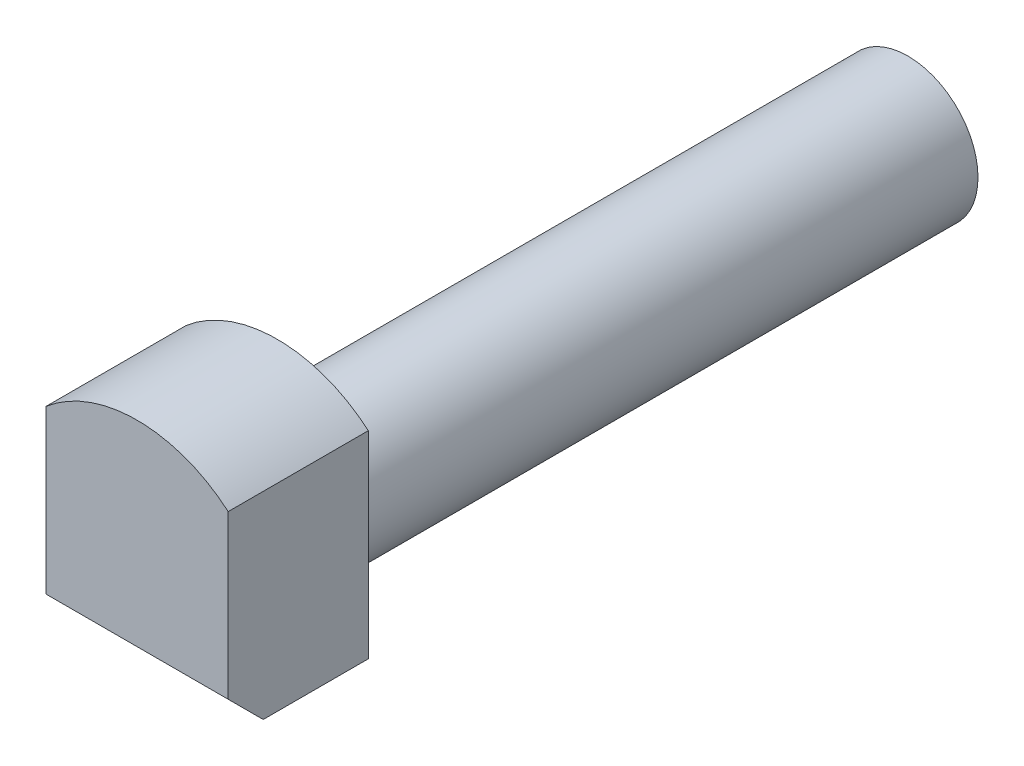
ISO-10303-21;
HEADER;
FILE_DESCRIPTION(('STEP AP214'),'2;1');
FILE_NAME('part.step','',(''),(''),'','','');
FILE_SCHEMA(('AUTOMOTIVE_DESIGN { 1 0 10303 214 1 1 1 1 }'));
ENDSEC;
DATA;
#1=APPLICATION_CONTEXT('core data for automotive mechanical design processes');
#2=APPLICATION_PROTOCOL_DEFINITION('international standard','automotive_design',2000,#1);
#3=PRODUCT_CONTEXT('',#1,'mechanical');
#4=PRODUCT('Part','Part','',(#3));
#5=PRODUCT_RELATED_PRODUCT_CATEGORY('part','',(#4));
#6=PRODUCT_DEFINITION_FORMATION('','',#4);
#7=PRODUCT_DEFINITION_CONTEXT('part definition',#1,'design');
#8=PRODUCT_DEFINITION('design','',#6,#7);
#9=PRODUCT_DEFINITION_SHAPE('','',#8);
#10=(LENGTH_UNIT() NAMED_UNIT(*) SI_UNIT(.MILLI.,.METRE.));
#11=(NAMED_UNIT(*) PLANE_ANGLE_UNIT() SI_UNIT($,.RADIAN.));
#12=(NAMED_UNIT(*) SI_UNIT($,.STERADIAN.) SOLID_ANGLE_UNIT());
#13=UNCERTAINTY_MEASURE_WITH_UNIT(LENGTH_MEASURE(1.E-05),#10,'distance_accuracy_value','');
#14=(GEOMETRIC_REPRESENTATION_CONTEXT(3) GLOBAL_UNCERTAINTY_ASSIGNED_CONTEXT((#13)) GLOBAL_UNIT_ASSIGNED_CONTEXT((#10,
#11,#12)) REPRESENTATION_CONTEXT('',''));
#15=CARTESIAN_POINT('',(0.,0.,0.));
#16=DIRECTION('',(0.,0.,1.));
#17=DIRECTION('',(1.,0.,0.));
#18=AXIS2_PLACEMENT_3D('',#15,#16,#17);
#19=CARTESIAN_POINT('',(2.7,1.35,-14.8284271247462));
#20=DIRECTION('',(0.,0.,1.));
#21=DIRECTION('',(1.,0.,0.));
#22=AXIS2_PLACEMENT_3D('',#19,#20,#21);
#23=CYLINDRICAL_SURFACE('',#22,1.);
#24=CARTESIAN_POINT('',(2.7,1.35,3.5));
#25=DIRECTION('',(0.,0.,1.));
#26=DIRECTION('',(1.,0.,0.));
#27=AXIS2_PLACEMENT_3D('',#24,#25,#26);
#28=CIRCLE('',#27,1.);
#29=CARTESIAN_POINT('',(3.7,1.35,3.5));
#30=VERTEX_POINT('',#29);
#31=EDGE_CURVE('E97',#30,#30,#28,.T.);
#32=ORIENTED_EDGE('',*,*,#31,.F.);
#33=EDGE_LOOP('',(#32));
#34=FACE_BOUND('',#33,.T.);
#35=CARTESIAN_POINT('',(2.7,1.35,-5.5));
#36=DIRECTION('',(0.,0.,-1.));
#37=DIRECTION('',(-1.,0.,0.));
#38=AXIS2_PLACEMENT_3D('',#35,#36,#37);
#39=CIRCLE('',#38,1.);
#40=CARTESIAN_POINT('',(1.7,1.35,-5.5));
#41=VERTEX_POINT('',#40);
#42=EDGE_CURVE('E141',#41,#41,#39,.T.);
#43=ORIENTED_EDGE('',*,*,#42,.F.);
#44=EDGE_LOOP('',(#43));
#45=FACE_BOUND('',#44,.T.);
#46=ADVANCED_FACE('F39',(#34,#45),#23,.T.);
#47=CARTESIAN_POINT('',(2.7,1.35,5.5));
#48=DIRECTION('',(0.,0.,-1.));
#49=DIRECTION('',(-1.,0.,0.));
#50=AXIS2_PLACEMENT_3D('',#47,#48,#49);
#51=CYLINDRICAL_SURFACE('',#50,2.);
#52=DIRECTION('',(0.,0.,1.));
#53=VECTOR('',#52,1.);
#54=CARTESIAN_POINT('',(4.,2.86986841535707,-11.));
#55=LINE('',#54,#53);
#56=CARTESIAN_POINT('',(4.,2.86986841535707,3.5));
#57=VERTEX_POINT('',#56);
#58=CARTESIAN_POINT('',(4.,2.86986841535707,5.5));
#59=VERTEX_POINT('',#58);
#60=EDGE_CURVE('E126',#57,#59,#55,.T.);
#61=ORIENTED_EDGE('',*,*,#60,.F.);
#62=CARTESIAN_POINT('',(2.7,1.35,3.5));
#63=DIRECTION('',(0.,0.,1.));
#64=DIRECTION('',(1.,0.,0.));
#65=AXIS2_PLACEMENT_3D('',#62,#63,#64);
#66=CIRCLE('',#65,2.);
#67=CARTESIAN_POINT('',(1.4,2.86986841535707,3.5));
#68=VERTEX_POINT('',#67);
#69=EDGE_CURVE('E113',#57,#68,#66,.T.);
#70=ORIENTED_EDGE('',*,*,#69,.T.);
#71=DIRECTION('',(0.,0.,1.));
#72=VECTOR('',#71,1.);
#73=CARTESIAN_POINT('',(1.4,2.86986841535707,-11.));
#74=LINE('',#73,#72);
#75=CARTESIAN_POINT('',(1.4,2.86986841535707,5.5));
#76=VERTEX_POINT('',#75);
#77=EDGE_CURVE('E91',#68,#76,#74,.T.);
#78=ORIENTED_EDGE('',*,*,#77,.T.);
#79=CARTESIAN_POINT('',(2.7,1.35,5.5));
#80=DIRECTION('',(0.,0.,-1.));
#81=DIRECTION('',(-1.,0.,0.));
#82=AXIS2_PLACEMENT_3D('',#79,#80,#81);
#83=CIRCLE('',#82,2.);
#84=EDGE_CURVE('E110',#59,#76,#83,.F.);
#85=ORIENTED_EDGE('',*,*,#84,.F.);
#86=EDGE_LOOP('',(#61,#70,#78,#85));
#87=FACE_BOUND('',#86,.T.);
#88=ADVANCED_FACE('F138',(#87),#51,.T.);
#89=CARTESIAN_POINT('',(2.7,1.35,5.5));
#90=DIRECTION('',(0.,0.,1.));
#91=DIRECTION('',(1.,0.,0.));
#92=AXIS2_PLACEMENT_3D('',#89,#90,#91);
#93=PLANE('',#92);
#94=DIRECTION('',(0.,-1.,0.));
#95=VECTOR('',#94,1.);
#96=CARTESIAN_POINT('',(1.4,1.35,5.5));
#97=LINE('',#96,#95);
#98=CARTESIAN_POINT('',(1.4,0.550000000000002,5.5));
#99=VERTEX_POINT('',#98);
#100=EDGE_CURVE('E122',#76,#99,#97,.T.);
#101=ORIENTED_EDGE('',*,*,#100,.T.);
#102=DIRECTION('',(1.,0.,0.));
#103=VECTOR('',#102,1.);
#104=CARTESIAN_POINT('',(2.7,0.550000000000002,5.5));
#105=LINE('',#104,#103);
#106=CARTESIAN_POINT('',(4.,0.550000000000002,5.5));
#107=VERTEX_POINT('',#106);
#108=EDGE_CURVE('E106',#99,#107,#105,.T.);
#109=ORIENTED_EDGE('',*,*,#108,.T.);
#110=DIRECTION('',(0.,1.,0.));
#111=VECTOR('',#110,1.);
#112=CARTESIAN_POINT('',(4.,1.35,5.5));
#113=LINE('',#112,#111);
#114=EDGE_CURVE('E120',#107,#59,#113,.T.);
#115=ORIENTED_EDGE('',*,*,#114,.T.);
#116=ORIENTED_EDGE('',*,*,#84,.T.);
#117=EDGE_LOOP('',(#101,#109,#115,#116));
#118=FACE_BOUND('',#117,.T.);
#119=ADVANCED_FACE('F119',(#118),#93,.T.);
#120=CARTESIAN_POINT('',(2.7,1.35,3.5));
#121=DIRECTION('',(0.,0.,1.));
#122=DIRECTION('',(1.,0.,0.));
#123=AXIS2_PLACEMENT_3D('',#120,#121,#122);
#124=PLANE('',#123);
#125=ORIENTED_EDGE('',*,*,#31,.T.);
#126=EDGE_LOOP('',(#125));
#127=FACE_BOUND('',#126,.T.);
#128=DIRECTION('',(0.,1.,0.));
#129=VECTOR('',#128,1.);
#130=CARTESIAN_POINT('',(4.,1.35,3.5));
#131=LINE('',#130,#129);
#132=CARTESIAN_POINT('',(4.,0.0499999999999998,3.5));
#133=VERTEX_POINT('',#132);
#134=EDGE_CURVE('E104',#133,#57,#131,.T.);
#135=ORIENTED_EDGE('',*,*,#134,.F.);
#136=DIRECTION('',(1.,0.,0.));
#137=VECTOR('',#136,1.);
#138=CARTESIAN_POINT('',(2.7,0.0499999999999999,3.5));
#139=LINE('',#138,#137);
#140=CARTESIAN_POINT('',(1.4,0.0499999999999998,3.5));
#141=VERTEX_POINT('',#140);
#142=EDGE_CURVE('E96',#141,#133,#139,.T.);
#143=ORIENTED_EDGE('',*,*,#142,.F.);
#144=DIRECTION('',(0.,-1.,0.));
#145=VECTOR('',#144,1.);
#146=CARTESIAN_POINT('',(1.4,1.35,3.5));
#147=LINE('',#146,#145);
#148=EDGE_CURVE('E86',#68,#141,#147,.T.);
#149=ORIENTED_EDGE('',*,*,#148,.F.);
#150=ORIENTED_EDGE('',*,*,#69,.F.);
#151=EDGE_LOOP('',(#135,#143,#149,#150));
#152=FACE_BOUND('',#151,.T.);
#153=ADVANCED_FACE('F103',(#127,#152),#124,.F.);
#154=CARTESIAN_POINT('',(4.,0.0499999999999998,-11.));
#155=DIRECTION('',(1.,0.,0.));
#156=DIRECTION('',(0.,0.,-1.));
#157=AXIS2_PLACEMENT_3D('',#154,#155,#156);
#158=PLANE('',#157);
#159=ORIENTED_EDGE('',*,*,#114,.F.);
#160=DIRECTION('',(0.,0.707106781186546,0.707106781186549));
#161=VECTOR('',#160,1.);
#162=CARTESIAN_POINT('',(4.,-7.95,-3.00000000000003));
#163=LINE('',#162,#161);
#164=CARTESIAN_POINT('',(4.,0.0499999999999998,5.));
#165=VERTEX_POINT('',#164);
#166=EDGE_CURVE('E62',#107,#165,#163,.F.);
#167=ORIENTED_EDGE('',*,*,#166,.T.);
#168=DIRECTION('',(0.,0.,1.));
#169=VECTOR('',#168,1.);
#170=CARTESIAN_POINT('',(4.,0.0499999999999998,-11.));
#171=LINE('',#170,#169);
#172=EDGE_CURVE('E100',#133,#165,#171,.T.);
#173=ORIENTED_EDGE('',*,*,#172,.F.);
#174=ORIENTED_EDGE('',*,*,#134,.T.);
#175=ORIENTED_EDGE('',*,*,#60,.T.);
#176=EDGE_LOOP('',(#159,#167,#173,#174,#175));
#177=FACE_BOUND('',#176,.T.);
#178=ADVANCED_FACE('F124',(#177),#158,.T.);
#179=CARTESIAN_POINT('',(1.4,0.0499999999999998,-11.));
#180=DIRECTION('',(0.,-1.,0.));
#181=DIRECTION('',(0.,0.,-1.));
#182=AXIS2_PLACEMENT_3D('',#179,#180,#181);
#183=PLANE('',#182);
#184=ORIENTED_EDGE('',*,*,#172,.T.);
#185=DIRECTION('',(-1.,0.,0.));
#186=VECTOR('',#185,1.);
#187=CARTESIAN_POINT('',(1.4,0.0499999999999998,5.));
#188=LINE('',#187,#186);
#189=CARTESIAN_POINT('',(1.4,0.0499999999999998,5.));
#190=VERTEX_POINT('',#189);
#191=EDGE_CURVE('E48',#165,#190,#188,.T.);
#192=ORIENTED_EDGE('',*,*,#191,.T.);
#193=DIRECTION('',(0.,0.,1.));
#194=VECTOR('',#193,1.);
#195=CARTESIAN_POINT('',(1.4,0.0499999999999998,-11.));
#196=LINE('',#195,#194);
#197=EDGE_CURVE('E88',#141,#190,#196,.T.);
#198=ORIENTED_EDGE('',*,*,#197,.F.);
#199=ORIENTED_EDGE('',*,*,#142,.T.);
#200=EDGE_LOOP('',(#184,#192,#198,#199));
#201=FACE_BOUND('',#200,.T.);
#202=ADVANCED_FACE('F99',(#201),#183,.T.);
#203=CARTESIAN_POINT('',(1.4,2.86986841535707,-11.));
#204=DIRECTION('',(-1.,0.,0.));
#205=DIRECTION('',(0.,0.,1.));
#206=AXIS2_PLACEMENT_3D('',#203,#204,#205);
#207=PLANE('',#206);
#208=ORIENTED_EDGE('',*,*,#197,.T.);
#209=DIRECTION('',(0.,-0.707106781186546,-0.707106781186549));
#210=VECTOR('',#209,1.);
#211=CARTESIAN_POINT('',(1.4,-6.54006579232147,-1.5900657923215));
#212=LINE('',#211,#210);
#213=EDGE_CURVE('E12',#190,#99,#212,.F.);
#214=ORIENTED_EDGE('',*,*,#213,.T.);
#215=ORIENTED_EDGE('',*,*,#100,.F.);
#216=ORIENTED_EDGE('',*,*,#77,.F.);
#217=ORIENTED_EDGE('',*,*,#148,.T.);
#218=EDGE_LOOP('',(#208,#214,#215,#216,#217));
#219=FACE_BOUND('',#218,.T.);
#220=ADVANCED_FACE('F87',(#219),#207,.T.);
#221=CARTESIAN_POINT('',(2.7,0.550000000000002,5.5));
#222=DIRECTION('',(0.,0.707106781186549,-0.707106781186546));
#223=DIRECTION('',(1.,0.,0.));
#224=AXIS2_PLACEMENT_3D('',#221,#222,#223);
#225=PLANE('',#224);
#226=ORIENTED_EDGE('',*,*,#213,.F.);
#227=ORIENTED_EDGE('',*,*,#191,.F.);
#228=ORIENTED_EDGE('',*,*,#166,.F.);
#229=ORIENTED_EDGE('',*,*,#108,.F.);
#230=EDGE_LOOP('',(#226,#227,#228,#229));
#231=FACE_BOUND('',#230,.T.);
#232=ADVANCED_FACE('F42',(#231),#225,.F.);
#233=CARTESIAN_POINT('',(2.7,1.35,-5.5));
#234=DIRECTION('',(0.,0.,-1.));
#235=DIRECTION('',(-1.,0.,0.));
#236=AXIS2_PLACEMENT_3D('',#233,#234,#235);
#237=PLANE('',#236);
#238=ORIENTED_EDGE('',*,*,#42,.T.);
#239=EDGE_LOOP('',(#238));
#240=FACE_BOUND('',#239,.T.);
#241=ADVANCED_FACE('F162',(#240),#237,.T.);
#242=CLOSED_SHELL('',(#46,#88,#119,#153,#178,#202,#220,#232,#241));
#243=MANIFOLD_SOLID_BREP('B2',#242);
#244=ADVANCED_BREP_SHAPE_REPRESENTATION('',(#18,#243),#14);
#245=SHAPE_DEFINITION_REPRESENTATION(#9,#244);
ENDSEC;
END-ISO-10303-21;
